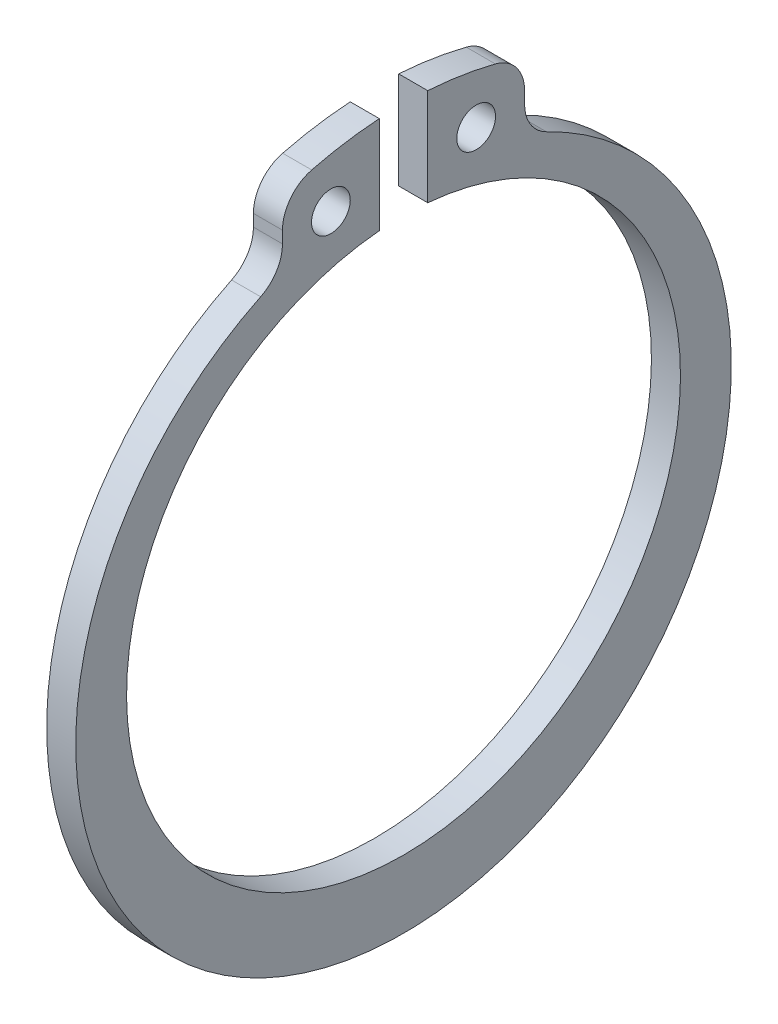
ISO-10303-21;
HEADER;
FILE_DESCRIPTION(('STEP AP214'),'2;1');
FILE_NAME('part.step','',(''),(''),'','','');
FILE_SCHEMA(('AUTOMOTIVE_DESIGN { 1 0 10303 214 1 1 1 1 }'));
ENDSEC;
DATA;
#1=APPLICATION_CONTEXT('core data for automotive mechanical design processes');
#2=APPLICATION_PROTOCOL_DEFINITION('international standard','automotive_design',2000,#1);
#3=PRODUCT_CONTEXT('',#1,'mechanical');
#4=PRODUCT('Part','Part','',(#3));
#5=PRODUCT_RELATED_PRODUCT_CATEGORY('part','',(#4));
#6=PRODUCT_DEFINITION_FORMATION('','',#4);
#7=PRODUCT_DEFINITION_CONTEXT('part definition',#1,'design');
#8=PRODUCT_DEFINITION('design','',#6,#7);
#9=PRODUCT_DEFINITION_SHAPE('','',#8);
#10=(LENGTH_UNIT() NAMED_UNIT(*) SI_UNIT(.MILLI.,.METRE.));
#11=(NAMED_UNIT(*) PLANE_ANGLE_UNIT() SI_UNIT($,.RADIAN.));
#12=(NAMED_UNIT(*) SI_UNIT($,.STERADIAN.) SOLID_ANGLE_UNIT());
#13=UNCERTAINTY_MEASURE_WITH_UNIT(LENGTH_MEASURE(1.E-05),#10,'distance_accuracy_value','');
#14=(GEOMETRIC_REPRESENTATION_CONTEXT(3) GLOBAL_UNCERTAINTY_ASSIGNED_CONTEXT((#13)) GLOBAL_UNIT_ASSIGNED_CONTEXT((#10,
#11,#12)) REPRESENTATION_CONTEXT('',''));
#15=CARTESIAN_POINT('',(0.,0.,0.));
#16=DIRECTION('',(0.,0.,1.));
#17=DIRECTION('',(1.,0.,0.));
#18=AXIS2_PLACEMENT_3D('',#15,#16,#17);
#19=CARTESIAN_POINT('',(1.5,16.1571203906033,8.25000000000016));
#20=DIRECTION('',(-1.,0.,0.));
#21=DIRECTION('',(0.,0.,1.));
#22=AXIS2_PLACEMENT_3D('',#19,#20,#21);
#23=PLANE('',#22);
#24=CARTESIAN_POINT('',(1.5,16.1571203906033,8.25000000000016));
#25=DIRECTION('',(-1.,0.,0.));
#26=DIRECTION('',(0.,0.,1.));
#27=AXIS2_PLACEMENT_3D('',#24,#25,#26);
#28=CIRCLE('',#27,2.00000000000016);
#29=CARTESIAN_POINT('',(1.5,16.1571203906032,6.25));
#30=VERTEX_POINT('',#29);
#31=CARTESIAN_POINT('',(1.5,14.3571605564553,7.37813728405532));
#32=VERTEX_POINT('',#31);
#33=EDGE_CURVE('E177',#30,#32,#28,.T.);
#34=ORIENTED_EDGE('',*,*,#33,.T.);
#35=CARTESIAN_POINT('',(1.5,-0.874999999999998,0.));
#36=DIRECTION('',(1.,0.,0.));
#37=DIRECTION('',(0.,0.,-1.));
#38=AXIS2_PLACEMENT_3D('',#35,#36,#37);
#39=CIRCLE('',#38,16.925);
#40=CARTESIAN_POINT('',(1.5,14.3571605078446,-7.37813738441216));
#41=VERTEX_POINT('',#40);
#42=EDGE_CURVE('E105',#32,#41,#39,.T.);
#43=ORIENTED_EDGE('',*,*,#42,.T.);
#44=CARTESIAN_POINT('',(1.5,16.1571203906032,-8.25000000000001));
#45=DIRECTION('',(-1.,0.,0.));
#46=DIRECTION('',(0.,0.,1.));
#47=AXIS2_PLACEMENT_3D('',#44,#45,#46);
#48=CIRCLE('',#47,2.00000000000001);
#49=CARTESIAN_POINT('',(1.5,16.1571203906032,-6.25));
#50=VERTEX_POINT('',#49);
#51=EDGE_CURVE('E204',#41,#50,#48,.T.);
#52=ORIENTED_EDGE('',*,*,#51,.T.);
#53=DIRECTION('',(0.,1.,0.));
#54=VECTOR('',#53,1.);
#55=CARTESIAN_POINT('',(1.5,16.1571203906032,-6.25));
#56=LINE('',#55,#54);
#57=CARTESIAN_POINT('',(1.5,16.7698389974382,-6.25));
#58=VERTEX_POINT('',#57);
#59=EDGE_CURVE('E223',#50,#58,#56,.T.);
#60=ORIENTED_EDGE('',*,*,#59,.T.);
#61=CARTESIAN_POINT('',(1.5,16.7698389974383,-4.25000000000013));
#62=DIRECTION('',(1.,0.,0.));
#63=DIRECTION('',(0.,0.,-1.));
#64=AXIS2_PLACEMENT_3D('',#61,#62,#63);
#65=CIRCLE('',#64,1.99999999999987);
#66=CARTESIAN_POINT('',(1.5,18.7085487184787,-4.74132943891353));
#67=VERTEX_POINT('',#66);
#68=EDGE_CURVE('E220',#58,#67,#65,.T.);
#69=ORIENTED_EDGE('',*,*,#68,.T.);
#70=CARTESIAN_POINT('',(1.5,4.8017145815038E-12,-7.15139752971439E-13));
#71=DIRECTION('',(1.,0.,0.));
#72=DIRECTION('',(0.,0.,-1.));
#73=AXIS2_PLACEMENT_3D('',#70,#71,#72);
#74=CIRCLE('',#73,19.2999999999951);
#75=CARTESIAN_POINT('',(1.5,19.2594781860776,-1.24999999999999));
#76=VERTEX_POINT('',#75);
#77=EDGE_CURVE('E222',#67,#76,#74,.T.);
#78=ORIENTED_EDGE('',*,*,#77,.T.);
#79=DIRECTION('',(0.,-1.,0.));
#80=VECTOR('',#79,1.);
#81=CARTESIAN_POINT('',(1.5,19.2594781860776,-1.24999999999999));
#82=LINE('',#81,#80);
#83=CARTESIAN_POINT('',(1.5,14.2452623703462,-1.24999999999999));
#84=VERTEX_POINT('',#83);
#85=EDGE_CURVE('E225',#76,#84,#82,.T.);
#86=ORIENTED_EDGE('',*,*,#85,.T.);
#87=CARTESIAN_POINT('',(1.5,4.8017145815038E-12,-7.15139752971439E-13));
#88=DIRECTION('',(-1.,0.,0.));
#89=DIRECTION('',(0.,0.,1.));
#90=AXIS2_PLACEMENT_3D('',#87,#88,#89);
#91=CIRCLE('',#90,14.2999999999953);
#92=CARTESIAN_POINT('',(1.5,14.2452623703461,1.25));
#93=VERTEX_POINT('',#92);
#94=EDGE_CURVE('E231',#84,#93,#91,.T.);
#95=ORIENTED_EDGE('',*,*,#94,.T.);
#96=DIRECTION('',(0.,1.,0.));
#97=VECTOR('',#96,1.);
#98=CARTESIAN_POINT('',(1.5,14.2452623703462,1.25));
#99=LINE('',#98,#97);
#100=CARTESIAN_POINT('',(1.5,19.2594781860776,1.25));
#101=VERTEX_POINT('',#100);
#102=EDGE_CURVE('E136',#93,#101,#99,.T.);
#103=ORIENTED_EDGE('',*,*,#102,.T.);
#104=CARTESIAN_POINT('',(1.5,4.8017145815038E-12,-7.15139752971439E-13));
#105=DIRECTION('',(1.,0.,0.));
#106=DIRECTION('',(0.,0.,-1.));
#107=AXIS2_PLACEMENT_3D('',#104,#105,#106);
#108=CIRCLE('',#107,19.2999999999954);
#109=CARTESIAN_POINT('',(1.5,18.7085486252926,4.74132980661077));
#110=VERTEX_POINT('',#109);
#111=EDGE_CURVE('E130',#101,#110,#108,.T.);
#112=ORIENTED_EDGE('',*,*,#111,.T.);
#113=CARTESIAN_POINT('',(1.5,16.7698389974382,4.24999999999994));
#114=DIRECTION('',(1.,0.,0.));
#115=DIRECTION('',(0.,0.,-1.));
#116=AXIS2_PLACEMENT_3D('',#113,#114,#115);
#117=CIRCLE('',#116,2.00000000000006);
#118=CARTESIAN_POINT('',(1.5,16.7698389974382,6.25));
#119=VERTEX_POINT('',#118);
#120=EDGE_CURVE('E134',#110,#119,#117,.T.);
#121=ORIENTED_EDGE('',*,*,#120,.T.);
#122=DIRECTION('',(0.,-1.,0.));
#123=VECTOR('',#122,1.);
#124=CARTESIAN_POINT('',(1.5,16.7698389974382,6.25));
#125=LINE('',#124,#123);
#126=EDGE_CURVE('E50',#119,#30,#125,.T.);
#127=ORIENTED_EDGE('',*,*,#126,.T.);
#128=EDGE_LOOP('',(#34,#43,#52,#60,#69,#78,#86,#95,#103,#112,#121,#127));
#129=FACE_BOUND('',#128,.T.);
#130=CARTESIAN_POINT('',(1.5,16.3658643452209,-3.75));
#131=DIRECTION('',(1.,0.,0.));
#132=DIRECTION('',(0.,0.,-1.));
#133=AXIS2_PLACEMENT_3D('',#130,#131,#132);
#134=CIRCLE('',#133,1.);
#135=CARTESIAN_POINT('',(1.5,16.3658643452209,-4.75));
#136=VERTEX_POINT('',#135);
#137=EDGE_CURVE('E158',#136,#136,#134,.T.);
#138=ORIENTED_EDGE('',*,*,#137,.F.);
#139=EDGE_LOOP('',(#138));
#140=FACE_BOUND('',#139,.T.);
#141=CARTESIAN_POINT('',(1.5,16.3658643452209,3.75));
#142=DIRECTION('',(1.,0.,0.));
#143=DIRECTION('',(0.,0.,-1.));
#144=AXIS2_PLACEMENT_3D('',#141,#142,#143);
#145=CIRCLE('',#144,1.);
#146=CARTESIAN_POINT('',(1.5,16.3658643452209,2.75));
#147=VERTEX_POINT('',#146);
#148=EDGE_CURVE('E272',#147,#147,#145,.T.);
#149=ORIENTED_EDGE('',*,*,#148,.F.);
#150=EDGE_LOOP('',(#149));
#151=FACE_BOUND('',#150,.T.);
#152=ADVANCED_FACE('F33',(#129,#140,#151),#23,.F.);
#153=CARTESIAN_POINT('',(0.,16.1571203906033,8.25000000000016));
#154=DIRECTION('',(-1.,0.,0.));
#155=DIRECTION('',(0.,0.,1.));
#156=AXIS2_PLACEMENT_3D('',#153,#154,#155);
#157=PLANE('',#156);
#158=CARTESIAN_POINT('',(0.,16.3658643452209,-3.75));
#159=DIRECTION('',(1.,0.,0.));
#160=DIRECTION('',(0.,0.,-1.));
#161=AXIS2_PLACEMENT_3D('',#158,#159,#160);
#162=CIRCLE('',#161,1.);
#163=CARTESIAN_POINT('',(0.,16.3658643452209,-4.75));
#164=VERTEX_POINT('',#163);
#165=EDGE_CURVE('E277',#164,#164,#162,.T.);
#166=ORIENTED_EDGE('',*,*,#165,.T.);
#167=EDGE_LOOP('',(#166));
#168=FACE_BOUND('',#167,.T.);
#169=CARTESIAN_POINT('',(0.,16.1571203906033,8.25000000000016));
#170=DIRECTION('',(-1.,0.,0.));
#171=DIRECTION('',(0.,0.,1.));
#172=AXIS2_PLACEMENT_3D('',#169,#170,#171);
#173=CIRCLE('',#172,2.00000000000016);
#174=CARTESIAN_POINT('',(0.,16.1571203906032,6.25));
#175=VERTEX_POINT('',#174);
#176=CARTESIAN_POINT('',(0.,14.3571605564553,7.37813728405532));
#177=VERTEX_POINT('',#176);
#178=EDGE_CURVE('E154',#175,#177,#173,.T.);
#179=ORIENTED_EDGE('',*,*,#178,.F.);
#180=DIRECTION('',(0.,-1.,0.));
#181=VECTOR('',#180,1.);
#182=CARTESIAN_POINT('',(0.,16.7698389974382,6.25));
#183=LINE('',#182,#181);
#184=CARTESIAN_POINT('',(0.,16.7698389974382,6.25));
#185=VERTEX_POINT('',#184);
#186=EDGE_CURVE('E97',#185,#175,#183,.T.);
#187=ORIENTED_EDGE('',*,*,#186,.F.);
#188=CARTESIAN_POINT('',(0.,16.7698389974382,4.24999999999994));
#189=DIRECTION('',(1.,0.,0.));
#190=DIRECTION('',(0.,0.,-1.));
#191=AXIS2_PLACEMENT_3D('',#188,#189,#190);
#192=CIRCLE('',#191,2.00000000000006);
#193=CARTESIAN_POINT('',(0.,18.7085486252926,4.74132980661077));
#194=VERTEX_POINT('',#193);
#195=EDGE_CURVE('E91',#194,#185,#192,.T.);
#196=ORIENTED_EDGE('',*,*,#195,.F.);
#197=CARTESIAN_POINT('',(0.,4.8017145815038E-12,-7.15139752971439E-13));
#198=DIRECTION('',(1.,0.,0.));
#199=DIRECTION('',(0.,0.,-1.));
#200=AXIS2_PLACEMENT_3D('',#197,#198,#199);
#201=CIRCLE('',#200,19.2999999999954);
#202=CARTESIAN_POINT('',(0.,19.2594781860776,1.25));
#203=VERTEX_POINT('',#202);
#204=EDGE_CURVE('E144',#203,#194,#201,.T.);
#205=ORIENTED_EDGE('',*,*,#204,.F.);
#206=DIRECTION('',(0.,1.,0.));
#207=VECTOR('',#206,1.);
#208=CARTESIAN_POINT('',(0.,14.2452623703462,1.25));
#209=LINE('',#208,#207);
#210=CARTESIAN_POINT('',(0.,14.2452623703461,1.25));
#211=VERTEX_POINT('',#210);
#212=EDGE_CURVE('E172',#211,#203,#209,.T.);
#213=ORIENTED_EDGE('',*,*,#212,.F.);
#214=CARTESIAN_POINT('',(0.,4.8017145815038E-12,-7.15139752971439E-13));
#215=DIRECTION('',(-1.,0.,0.));
#216=DIRECTION('',(0.,0.,1.));
#217=AXIS2_PLACEMENT_3D('',#214,#215,#216);
#218=CIRCLE('',#217,14.2999999999953);
#219=CARTESIAN_POINT('',(0.,14.2452623703462,-1.24999999999999));
#220=VERTEX_POINT('',#219);
#221=EDGE_CURVE('E170',#220,#211,#218,.T.);
#222=ORIENTED_EDGE('',*,*,#221,.F.);
#223=DIRECTION('',(0.,-1.,0.));
#224=VECTOR('',#223,1.);
#225=CARTESIAN_POINT('',(0.,19.2594781860776,-1.24999999999999));
#226=LINE('',#225,#224);
#227=CARTESIAN_POINT('',(0.,19.2594781860776,-1.24999999999999));
#228=VERTEX_POINT('',#227);
#229=EDGE_CURVE('E168',#228,#220,#226,.T.);
#230=ORIENTED_EDGE('',*,*,#229,.F.);
#231=CARTESIAN_POINT('',(0.,4.8017145815038E-12,-7.15139752971439E-13));
#232=DIRECTION('',(1.,0.,0.));
#233=DIRECTION('',(0.,0.,-1.));
#234=AXIS2_PLACEMENT_3D('',#231,#232,#233);
#235=CIRCLE('',#234,19.2999999999951);
#236=CARTESIAN_POINT('',(0.,18.7085487184787,-4.74132943891353));
#237=VERTEX_POINT('',#236);
#238=EDGE_CURVE('E166',#237,#228,#235,.T.);
#239=ORIENTED_EDGE('',*,*,#238,.F.);
#240=CARTESIAN_POINT('',(0.,16.7698389974383,-4.25000000000013));
#241=DIRECTION('',(1.,0.,0.));
#242=DIRECTION('',(0.,0.,-1.));
#243=AXIS2_PLACEMENT_3D('',#240,#241,#242);
#244=CIRCLE('',#243,1.99999999999987);
#245=CARTESIAN_POINT('',(0.,16.7698389974382,-6.25));
#246=VERTEX_POINT('',#245);
#247=EDGE_CURVE('E164',#246,#237,#244,.T.);
#248=ORIENTED_EDGE('',*,*,#247,.F.);
#249=DIRECTION('',(0.,1.,0.));
#250=VECTOR('',#249,1.);
#251=CARTESIAN_POINT('',(0.,16.1571203906032,-6.25));
#252=LINE('',#251,#250);
#253=CARTESIAN_POINT('',(0.,16.1571203906032,-6.25));
#254=VERTEX_POINT('',#253);
#255=EDGE_CURVE('E162',#254,#246,#252,.T.);
#256=ORIENTED_EDGE('',*,*,#255,.F.);
#257=CARTESIAN_POINT('',(0.,16.1571203906032,-8.25000000000001));
#258=DIRECTION('',(-1.,0.,0.));
#259=DIRECTION('',(0.,0.,1.));
#260=AXIS2_PLACEMENT_3D('',#257,#258,#259);
#261=CIRCLE('',#260,2.00000000000001);
#262=CARTESIAN_POINT('',(0.,14.3571605078446,-7.37813738441216));
#263=VERTEX_POINT('',#262);
#264=EDGE_CURVE('E160',#263,#254,#261,.T.);
#265=ORIENTED_EDGE('',*,*,#264,.F.);
#266=CARTESIAN_POINT('',(0.,-0.874999999999998,0.));
#267=DIRECTION('',(1.,0.,0.));
#268=DIRECTION('',(0.,0.,-1.));
#269=AXIS2_PLACEMENT_3D('',#266,#267,#268);
#270=CIRCLE('',#269,16.925);
#271=EDGE_CURVE('E157',#177,#263,#270,.T.);
#272=ORIENTED_EDGE('',*,*,#271,.F.);
#273=EDGE_LOOP('',(#179,#187,#196,#205,#213,#222,#230,#239,#248,#256,#265,#272));
#274=FACE_BOUND('',#273,.T.);
#275=CARTESIAN_POINT('',(0.,16.3658643452209,3.75));
#276=DIRECTION('',(1.,0.,0.));
#277=DIRECTION('',(0.,0.,-1.));
#278=AXIS2_PLACEMENT_3D('',#275,#276,#277);
#279=CIRCLE('',#278,1.);
#280=CARTESIAN_POINT('',(0.,16.3658643452209,2.75));
#281=VERTEX_POINT('',#280);
#282=EDGE_CURVE('E275',#281,#281,#279,.T.);
#283=ORIENTED_EDGE('',*,*,#282,.T.);
#284=EDGE_LOOP('',(#283));
#285=FACE_BOUND('',#284,.T.);
#286=ADVANCED_FACE('F208',(#168,#274,#285),#157,.T.);
#287=CARTESIAN_POINT('',(1.5,16.1571203906033,8.25000000000016));
#288=DIRECTION('',(-1.,0.,0.));
#289=DIRECTION('',(0.,0.,1.));
#290=AXIS2_PLACEMENT_3D('',#287,#288,#289);
#291=CYLINDRICAL_SURFACE('',#290,2.00000000000016);
#292=ORIENTED_EDGE('',*,*,#178,.T.);
#293=DIRECTION('',(-1.,0.,0.));
#294=VECTOR('',#293,1.);
#295=CARTESIAN_POINT('',(1.5,14.3571605564553,7.37813728405532));
#296=LINE('',#295,#294);
#297=EDGE_CURVE('E11',#32,#177,#296,.T.);
#298=ORIENTED_EDGE('',*,*,#297,.F.);
#299=ORIENTED_EDGE('',*,*,#33,.F.);
#300=DIRECTION('',(-1.,0.,0.));
#301=VECTOR('',#300,1.);
#302=CARTESIAN_POINT('',(1.5,16.1571203906032,6.25));
#303=LINE('',#302,#301);
#304=EDGE_CURVE('E150',#30,#175,#303,.T.);
#305=ORIENTED_EDGE('',*,*,#304,.T.);
#306=EDGE_LOOP('',(#292,#298,#299,#305));
#307=FACE_BOUND('',#306,.T.);
#308=ADVANCED_FACE('F35',(#307),#291,.F.);
#309=CARTESIAN_POINT('',(1.5,-0.874999999999998,0.));
#310=DIRECTION('',(-1.,0.,0.));
#311=DIRECTION('',(0.,0.,1.));
#312=AXIS2_PLACEMENT_3D('',#309,#310,#311);
#313=CYLINDRICAL_SURFACE('',#312,16.925);
#314=ORIENTED_EDGE('',*,*,#271,.T.);
#315=DIRECTION('',(-1.,0.,0.));
#316=VECTOR('',#315,1.);
#317=CARTESIAN_POINT('',(1.5,14.3571605078446,-7.37813738441216));
#318=LINE('',#317,#316);
#319=EDGE_CURVE('E42',#41,#263,#318,.T.);
#320=ORIENTED_EDGE('',*,*,#319,.F.);
#321=ORIENTED_EDGE('',*,*,#42,.F.);
#322=ORIENTED_EDGE('',*,*,#297,.T.);
#323=EDGE_LOOP('',(#314,#320,#321,#322));
#324=FACE_BOUND('',#323,.T.);
#325=ADVANCED_FACE('F372',(#324),#313,.T.);
#326=CARTESIAN_POINT('',(1.5,16.1571203906032,-8.25000000000001));
#327=DIRECTION('',(-1.,0.,0.));
#328=DIRECTION('',(0.,0.,1.));
#329=AXIS2_PLACEMENT_3D('',#326,#327,#328);
#330=CYLINDRICAL_SURFACE('',#329,2.00000000000001);
#331=ORIENTED_EDGE('',*,*,#264,.T.);
#332=DIRECTION('',(-1.,0.,0.));
#333=VECTOR('',#332,1.);
#334=CARTESIAN_POINT('',(1.5,16.1571203906032,-6.25));
#335=LINE('',#334,#333);
#336=EDGE_CURVE('E196',#50,#254,#335,.T.);
#337=ORIENTED_EDGE('',*,*,#336,.F.);
#338=ORIENTED_EDGE('',*,*,#51,.F.);
#339=ORIENTED_EDGE('',*,*,#319,.T.);
#340=EDGE_LOOP('',(#331,#337,#338,#339));
#341=FACE_BOUND('',#340,.T.);
#342=ADVANCED_FACE('F202',(#341),#330,.F.);
#343=CARTESIAN_POINT('',(1.5,16.1571203906032,-6.25));
#344=DIRECTION('',(0.,0.,1.));
#345=DIRECTION('',(1.,0.,0.));
#346=AXIS2_PLACEMENT_3D('',#343,#344,#345);
#347=PLANE('',#346);
#348=ORIENTED_EDGE('',*,*,#255,.T.);
#349=DIRECTION('',(-1.,0.,0.));
#350=VECTOR('',#349,1.);
#351=CARTESIAN_POINT('',(1.5,16.7698389974382,-6.25));
#352=LINE('',#351,#350);
#353=EDGE_CURVE('E193',#58,#246,#352,.T.);
#354=ORIENTED_EDGE('',*,*,#353,.F.);
#355=ORIENTED_EDGE('',*,*,#59,.F.);
#356=ORIENTED_EDGE('',*,*,#336,.T.);
#357=EDGE_LOOP('',(#348,#354,#355,#356));
#358=FACE_BOUND('',#357,.T.);
#359=ADVANCED_FACE('F214',(#358),#347,.F.);
#360=CARTESIAN_POINT('',(1.5,16.7698389974383,-4.25000000000013));
#361=DIRECTION('',(-1.,0.,0.));
#362=DIRECTION('',(0.,0.,1.));
#363=AXIS2_PLACEMENT_3D('',#360,#361,#362);
#364=CYLINDRICAL_SURFACE('',#363,1.99999999999987);
#365=ORIENTED_EDGE('',*,*,#247,.T.);
#366=DIRECTION('',(-1.,0.,0.));
#367=VECTOR('',#366,1.);
#368=CARTESIAN_POINT('',(1.5,18.7085487184787,-4.74132943891353));
#369=LINE('',#368,#367);
#370=EDGE_CURVE('E190',#67,#237,#369,.T.);
#371=ORIENTED_EDGE('',*,*,#370,.F.);
#372=ORIENTED_EDGE('',*,*,#68,.F.);
#373=ORIENTED_EDGE('',*,*,#353,.T.);
#374=EDGE_LOOP('',(#365,#371,#372,#373));
#375=FACE_BOUND('',#374,.T.);
#376=ADVANCED_FACE('F218',(#375),#364,.T.);
#377=CARTESIAN_POINT('',(1.5,4.8017145815038E-12,-7.15139752971439E-13));
#378=DIRECTION('',(-1.,0.,0.));
#379=DIRECTION('',(0.,0.,1.));
#380=AXIS2_PLACEMENT_3D('',#377,#378,#379);
#381=CYLINDRICAL_SURFACE('',#380,19.2999999999951);
#382=ORIENTED_EDGE('',*,*,#238,.T.);
#383=DIRECTION('',(-1.,0.,0.));
#384=VECTOR('',#383,1.);
#385=CARTESIAN_POINT('',(1.5,19.2594781860776,-1.24999999999999));
#386=LINE('',#385,#384);
#387=EDGE_CURVE('E187',#76,#228,#386,.T.);
#388=ORIENTED_EDGE('',*,*,#387,.F.);
#389=ORIENTED_EDGE('',*,*,#77,.F.);
#390=ORIENTED_EDGE('',*,*,#370,.T.);
#391=EDGE_LOOP('',(#382,#388,#389,#390));
#392=FACE_BOUND('',#391,.T.);
#393=ADVANCED_FACE('F337',(#392),#381,.T.);
#394=CARTESIAN_POINT('',(1.5,19.2594781860776,-1.24999999999999));
#395=DIRECTION('',(0.,0.,-1.));
#396=DIRECTION('',(-1.,0.,0.));
#397=AXIS2_PLACEMENT_3D('',#394,#395,#396);
#398=PLANE('',#397);
#399=ORIENTED_EDGE('',*,*,#229,.T.);
#400=DIRECTION('',(-1.,0.,0.));
#401=VECTOR('',#400,1.);
#402=CARTESIAN_POINT('',(1.5,14.2452623703462,-1.24999999999999));
#403=LINE('',#402,#401);
#404=EDGE_CURVE('E184',#84,#220,#403,.T.);
#405=ORIENTED_EDGE('',*,*,#404,.F.);
#406=ORIENTED_EDGE('',*,*,#85,.F.);
#407=ORIENTED_EDGE('',*,*,#387,.T.);
#408=EDGE_LOOP('',(#399,#405,#406,#407));
#409=FACE_BOUND('',#408,.T.);
#410=ADVANCED_FACE('F328',(#409),#398,.F.);
#411=CARTESIAN_POINT('',(1.5,4.8017145815038E-12,-7.15139752971439E-13));
#412=DIRECTION('',(-1.,0.,0.));
#413=DIRECTION('',(0.,0.,1.));
#414=AXIS2_PLACEMENT_3D('',#411,#412,#413);
#415=CYLINDRICAL_SURFACE('',#414,14.2999999999953);
#416=ORIENTED_EDGE('',*,*,#221,.T.);
#417=DIRECTION('',(-1.,0.,0.));
#418=VECTOR('',#417,1.);
#419=CARTESIAN_POINT('',(1.5,14.2452623703461,1.25));
#420=LINE('',#419,#418);
#421=EDGE_CURVE('E181',#93,#211,#420,.T.);
#422=ORIENTED_EDGE('',*,*,#421,.F.);
#423=ORIENTED_EDGE('',*,*,#94,.F.);
#424=ORIENTED_EDGE('',*,*,#404,.T.);
#425=EDGE_LOOP('',(#416,#422,#423,#424));
#426=FACE_BOUND('',#425,.T.);
#427=ADVANCED_FACE('F237',(#426),#415,.F.);
#428=CARTESIAN_POINT('',(1.5,14.2452623703462,1.25));
#429=DIRECTION('',(0.,0.,1.));
#430=DIRECTION('',(1.,0.,0.));
#431=AXIS2_PLACEMENT_3D('',#428,#429,#430);
#432=PLANE('',#431);
#433=ORIENTED_EDGE('',*,*,#212,.T.);
#434=DIRECTION('',(-1.,0.,0.));
#435=VECTOR('',#434,1.);
#436=CARTESIAN_POINT('',(1.5,19.2594781860776,1.25));
#437=LINE('',#436,#435);
#438=EDGE_CURVE('E145',#101,#203,#437,.T.);
#439=ORIENTED_EDGE('',*,*,#438,.F.);
#440=ORIENTED_EDGE('',*,*,#102,.F.);
#441=ORIENTED_EDGE('',*,*,#421,.T.);
#442=EDGE_LOOP('',(#433,#439,#440,#441));
#443=FACE_BOUND('',#442,.T.);
#444=ADVANCED_FACE('F241',(#443),#432,.F.);
#445=CARTESIAN_POINT('',(1.5,4.8017145815038E-12,-7.15139752971439E-13));
#446=DIRECTION('',(-1.,0.,0.));
#447=DIRECTION('',(0.,0.,1.));
#448=AXIS2_PLACEMENT_3D('',#445,#446,#447);
#449=CYLINDRICAL_SURFACE('',#448,19.2999999999954);
#450=ORIENTED_EDGE('',*,*,#204,.T.);
#451=DIRECTION('',(-1.,0.,0.));
#452=VECTOR('',#451,1.);
#453=CARTESIAN_POINT('',(1.5,18.7085486252926,4.74132980661077));
#454=LINE('',#453,#452);
#455=EDGE_CURVE('E141',#110,#194,#454,.T.);
#456=ORIENTED_EDGE('',*,*,#455,.F.);
#457=ORIENTED_EDGE('',*,*,#111,.F.);
#458=ORIENTED_EDGE('',*,*,#438,.T.);
#459=EDGE_LOOP('',(#450,#456,#457,#458));
#460=FACE_BOUND('',#459,.T.);
#461=ADVANCED_FACE('F142',(#460),#449,.T.);
#462=CARTESIAN_POINT('',(1.5,16.7698389974382,4.24999999999994));
#463=DIRECTION('',(-1.,0.,0.));
#464=DIRECTION('',(0.,0.,1.));
#465=AXIS2_PLACEMENT_3D('',#462,#463,#464);
#466=CYLINDRICAL_SURFACE('',#465,2.00000000000006);
#467=ORIENTED_EDGE('',*,*,#195,.T.);
#468=DIRECTION('',(-1.,0.,0.));
#469=VECTOR('',#468,1.);
#470=CARTESIAN_POINT('',(1.5,16.7698389974382,6.25));
#471=LINE('',#470,#469);
#472=EDGE_CURVE('E146',#119,#185,#471,.T.);
#473=ORIENTED_EDGE('',*,*,#472,.F.);
#474=ORIENTED_EDGE('',*,*,#120,.F.);
#475=ORIENTED_EDGE('',*,*,#455,.T.);
#476=EDGE_LOOP('',(#467,#473,#474,#475));
#477=FACE_BOUND('',#476,.T.);
#478=ADVANCED_FACE('F148',(#477),#466,.T.);
#479=CARTESIAN_POINT('',(1.5,16.7698389974382,6.25));
#480=DIRECTION('',(0.,0.,-1.));
#481=DIRECTION('',(-1.,0.,0.));
#482=AXIS2_PLACEMENT_3D('',#479,#480,#481);
#483=PLANE('',#482);
#484=ORIENTED_EDGE('',*,*,#186,.T.);
#485=ORIENTED_EDGE('',*,*,#304,.F.);
#486=ORIENTED_EDGE('',*,*,#126,.F.);
#487=ORIENTED_EDGE('',*,*,#472,.T.);
#488=EDGE_LOOP('',(#484,#485,#486,#487));
#489=FACE_BOUND('',#488,.T.);
#490=ADVANCED_FACE('F245',(#489),#483,.F.);
#491=CARTESIAN_POINT('',(1.5,16.3658643452209,-3.75));
#492=DIRECTION('',(-1.,0.,0.));
#493=DIRECTION('',(0.,0.,1.));
#494=AXIS2_PLACEMENT_3D('',#491,#492,#493);
#495=CYLINDRICAL_SURFACE('',#494,1.);
#496=ORIENTED_EDGE('',*,*,#137,.T.);
#497=EDGE_LOOP('',(#496));
#498=FACE_BOUND('',#497,.T.);
#499=ORIENTED_EDGE('',*,*,#165,.F.);
#500=EDGE_LOOP('',(#499));
#501=FACE_BOUND('',#500,.T.);
#502=ADVANCED_FACE('F247',(#498,#501),#495,.F.);
#503=CARTESIAN_POINT('',(1.5,16.3658643452209,3.75));
#504=DIRECTION('',(-1.,0.,0.));
#505=DIRECTION('',(0.,0.,1.));
#506=AXIS2_PLACEMENT_3D('',#503,#504,#505);
#507=CYLINDRICAL_SURFACE('',#506,1.);
#508=ORIENTED_EDGE('',*,*,#148,.T.);
#509=EDGE_LOOP('',(#508));
#510=FACE_BOUND('',#509,.T.);
#511=ORIENTED_EDGE('',*,*,#282,.F.);
#512=EDGE_LOOP('',(#511));
#513=FACE_BOUND('',#512,.T.);
#514=ADVANCED_FACE('F253',(#510,#513),#507,.F.);
#515=CLOSED_SHELL('',(#152,#286,#308,#325,#342,#359,#376,#393,#410,#427,#444,#461,#478,#490,
#502,#514));
#516=MANIFOLD_SOLID_BREP('B2',#515);
#517=ADVANCED_BREP_SHAPE_REPRESENTATION('',(#18,#516),#14);
#518=SHAPE_DEFINITION_REPRESENTATION(#9,#517);
ENDSEC;
END-ISO-10303-21;
